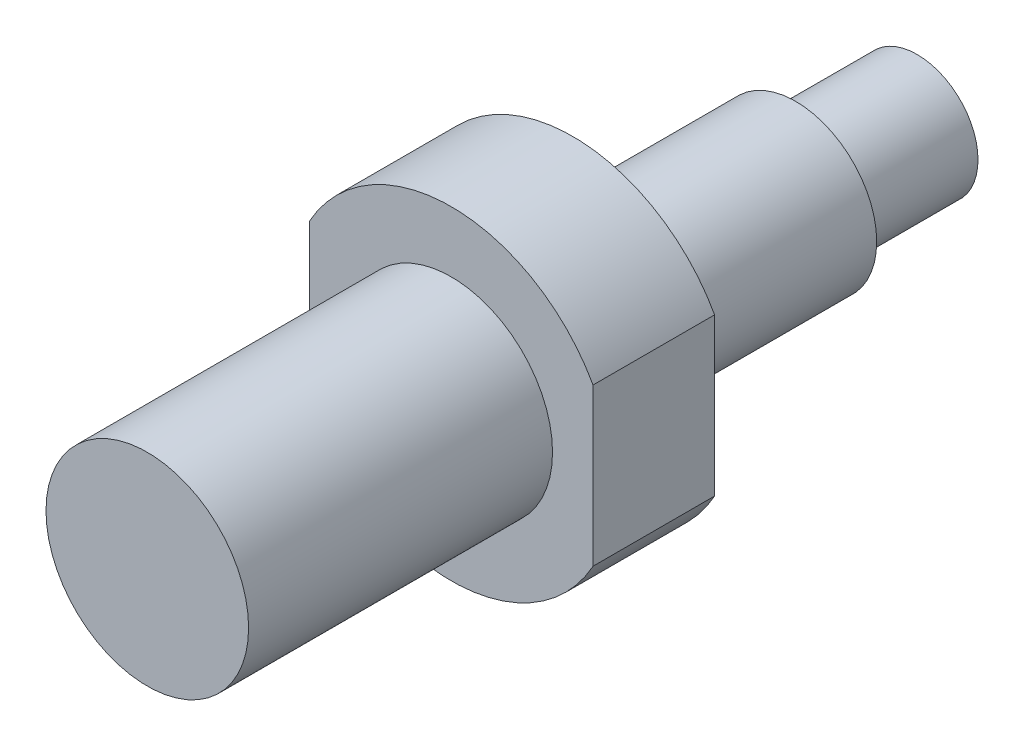
ISO-10303-21;
HEADER;
FILE_DESCRIPTION(('STEP AP214'),'2;1');
FILE_NAME('part.step','',(''),(''),'','','');
FILE_SCHEMA(('AUTOMOTIVE_DESIGN { 1 0 10303 214 1 1 1 1 }'));
ENDSEC;
DATA;
#1=APPLICATION_CONTEXT('core data for automotive mechanical design processes');
#2=APPLICATION_PROTOCOL_DEFINITION('international standard','automotive_design',2000,#1);
#3=PRODUCT_CONTEXT('',#1,'mechanical');
#4=PRODUCT('Part','Part','',(#3));
#5=PRODUCT_RELATED_PRODUCT_CATEGORY('part','',(#4));
#6=PRODUCT_DEFINITION_FORMATION('','',#4);
#7=PRODUCT_DEFINITION_CONTEXT('part definition',#1,'design');
#8=PRODUCT_DEFINITION('design','',#6,#7);
#9=PRODUCT_DEFINITION_SHAPE('','',#8);
#10=(LENGTH_UNIT() NAMED_UNIT(*) SI_UNIT(.MILLI.,.METRE.));
#11=(NAMED_UNIT(*) PLANE_ANGLE_UNIT() SI_UNIT($,.RADIAN.));
#12=(NAMED_UNIT(*) SI_UNIT($,.STERADIAN.) SOLID_ANGLE_UNIT());
#13=UNCERTAINTY_MEASURE_WITH_UNIT(LENGTH_MEASURE(1.E-05),#10,'distance_accuracy_value','');
#14=(GEOMETRIC_REPRESENTATION_CONTEXT(3) GLOBAL_UNCERTAINTY_ASSIGNED_CONTEXT((#13)) GLOBAL_UNIT_ASSIGNED_CONTEXT((#10,
#11,#12)) REPRESENTATION_CONTEXT('',''));
#15=CARTESIAN_POINT('',(0.,0.,0.));
#16=DIRECTION('',(0.,0.,1.));
#17=DIRECTION('',(1.,0.,0.));
#18=AXIS2_PLACEMENT_3D('',#15,#16,#17);
#19=CARTESIAN_POINT('',(0.,4.,-32.));
#20=DIRECTION('',(0.,0.,1.));
#21=DIRECTION('',(1.,0.,0.));
#22=AXIS2_PLACEMENT_3D('',#19,#20,#21);
#23=PLANE('',#22);
#24=CARTESIAN_POINT('',(0.,0.,-32.));
#25=DIRECTION('',(0.,0.,1.));
#26=DIRECTION('',(1.,0.,0.));
#27=AXIS2_PLACEMENT_3D('',#24,#25,#26);
#28=CIRCLE('',#27,4.);
#29=CARTESIAN_POINT('',(4.,0.,-32.));
#30=VERTEX_POINT('',#29);
#31=EDGE_CURVE('E125',#30,#30,#28,.T.);
#32=ORIENTED_EDGE('',*,*,#31,.F.);
#33=EDGE_LOOP('',(#32));
#34=FACE_BOUND('',#33,.T.);
#35=CARTESIAN_POINT('',(0.,0.,-32.));
#36=DIRECTION('',(0.,0.,1.));
#37=DIRECTION('',(1.,0.,0.));
#38=AXIS2_PLACEMENT_3D('',#35,#36,#37);
#39=CIRCLE('',#38,3.);
#40=CARTESIAN_POINT('',(3.,0.,-32.));
#41=VERTEX_POINT('',#40);
#42=EDGE_CURVE('E12',#41,#41,#39,.F.);
#43=ORIENTED_EDGE('',*,*,#42,.F.);
#44=EDGE_LOOP('',(#43));
#45=FACE_BOUND('',#44,.T.);
#46=ADVANCED_FACE('F40',(#34,#45),#23,.F.);
#47=CARTESIAN_POINT('',(0.,5.,-15.));
#48=DIRECTION('',(0.,0.,-1.));
#49=DIRECTION('',(-1.,0.,0.));
#50=AXIS2_PLACEMENT_3D('',#47,#48,#49);
#51=PLANE('',#50);
#52=CARTESIAN_POINT('',(0.,0.,-15.));
#53=DIRECTION('',(0.,0.,1.));
#54=DIRECTION('',(1.,0.,0.));
#55=AXIS2_PLACEMENT_3D('',#52,#53,#54);
#56=CIRCLE('',#55,5.);
#57=CARTESIAN_POINT('',(5.,0.,-15.));
#58=VERTEX_POINT('',#57);
#59=EDGE_CURVE('E106',#58,#58,#56,.T.);
#60=ORIENTED_EDGE('',*,*,#59,.F.);
#61=EDGE_LOOP('',(#60));
#62=FACE_BOUND('',#61,.T.);
#63=CARTESIAN_POINT('',(0.,0.,-15.));
#64=DIRECTION('',(0.,0.,-1.));
#65=DIRECTION('',(-1.,0.,0.));
#66=AXIS2_PLACEMENT_3D('',#63,#64,#65);
#67=CIRCLE('',#66,8.);
#68=CARTESIAN_POINT('',(-7.,3.87298334620742,-15.));
#69=VERTEX_POINT('',#68);
#70=CARTESIAN_POINT('',(7.,3.87298334620742,-15.));
#71=VERTEX_POINT('',#70);
#72=EDGE_CURVE('E82',#69,#71,#67,.T.);
#73=ORIENTED_EDGE('',*,*,#72,.F.);
#74=DIRECTION('',(0.,1.,0.));
#75=VECTOR('',#74,1.);
#76=CARTESIAN_POINT('',(-7.,-8.43799237337698,-15.));
#77=LINE('',#76,#75);
#78=CARTESIAN_POINT('',(-7.,-3.87298334620742,-15.));
#79=VERTEX_POINT('',#78);
#80=EDGE_CURVE('E116',#79,#69,#77,.T.);
#81=ORIENTED_EDGE('',*,*,#80,.F.);
#82=CARTESIAN_POINT('',(7.,-3.87298334620742,-15.));
#83=VERTEX_POINT('',#82);
#84=EDGE_CURVE('E55',#83,#79,#67,.T.);
#85=ORIENTED_EDGE('',*,*,#84,.F.);
#86=DIRECTION('',(0.,-1.,0.));
#87=VECTOR('',#86,1.);
#88=CARTESIAN_POINT('',(7.,-8.43799237337698,-15.));
#89=LINE('',#88,#87);
#90=EDGE_CURVE('E119',#71,#83,#89,.T.);
#91=ORIENTED_EDGE('',*,*,#90,.F.);
#92=EDGE_LOOP('',(#73,#81,#85,#91));
#93=FACE_BOUND('',#92,.T.);
#94=ADVANCED_FACE('F118',(#62,#93),#51,.F.);
#95=CARTESIAN_POINT('',(0.,9.,-21.));
#96=DIRECTION('',(0.,0.,1.));
#97=DIRECTION('',(1.,0.,0.));
#98=AXIS2_PLACEMENT_3D('',#95,#96,#97);
#99=PLANE('',#98);
#100=CARTESIAN_POINT('',(0.,0.,-21.));
#101=DIRECTION('',(0.,0.,1.));
#102=DIRECTION('',(1.,0.,0.));
#103=AXIS2_PLACEMENT_3D('',#100,#101,#102);
#104=CIRCLE('',#103,4.);
#105=CARTESIAN_POINT('',(4.,0.,-21.));
#106=VERTEX_POINT('',#105);
#107=EDGE_CURVE('E128',#106,#106,#104,.T.);
#108=ORIENTED_EDGE('',*,*,#107,.T.);
#109=EDGE_LOOP('',(#108));
#110=FACE_BOUND('',#109,.T.);
#111=CARTESIAN_POINT('',(0.,0.,-21.));
#112=DIRECTION('',(0.,0.,-1.));
#113=DIRECTION('',(-1.,0.,0.));
#114=AXIS2_PLACEMENT_3D('',#111,#112,#113);
#115=CIRCLE('',#114,8.);
#116=CARTESIAN_POINT('',(-7.,3.87298334620742,-21.));
#117=VERTEX_POINT('',#116);
#118=CARTESIAN_POINT('',(7.,3.87298334620742,-21.));
#119=VERTEX_POINT('',#118);
#120=EDGE_CURVE('E63',#117,#119,#115,.T.);
#121=ORIENTED_EDGE('',*,*,#120,.T.);
#122=DIRECTION('',(0.,-1.,0.));
#123=VECTOR('',#122,1.);
#124=CARTESIAN_POINT('',(7.,9.,-21.));
#125=LINE('',#124,#123);
#126=CARTESIAN_POINT('',(7.,-3.87298334620742,-21.));
#127=VERTEX_POINT('',#126);
#128=EDGE_CURVE('E93',#119,#127,#125,.T.);
#129=ORIENTED_EDGE('',*,*,#128,.T.);
#130=CARTESIAN_POINT('',(-7.,-3.87298334620742,-21.));
#131=VERTEX_POINT('',#130);
#132=EDGE_CURVE('E96',#127,#131,#115,.T.);
#133=ORIENTED_EDGE('',*,*,#132,.T.);
#134=DIRECTION('',(0.,1.,0.));
#135=VECTOR('',#134,1.);
#136=CARTESIAN_POINT('',(-7.,9.,-21.));
#137=LINE('',#136,#135);
#138=EDGE_CURVE('E95',#131,#117,#137,.T.);
#139=ORIENTED_EDGE('',*,*,#138,.T.);
#140=EDGE_LOOP('',(#121,#129,#133,#139));
#141=FACE_BOUND('',#140,.T.);
#142=ADVANCED_FACE('F91',(#110,#141),#99,.F.);
#143=CARTESIAN_POINT('',(7.,-8.43799237337698,-25.));
#144=DIRECTION('',(-1.,0.,0.));
#145=DIRECTION('',(0.,0.,1.));
#146=AXIS2_PLACEMENT_3D('',#143,#144,#145);
#147=PLANE('',#146);
#148=DIRECTION('',(0.,0.,-1.));
#149=VECTOR('',#148,1.);
#150=CARTESIAN_POINT('',(7.,3.87298334620742,-11.));
#151=LINE('',#150,#149);
#152=EDGE_CURVE('E79',#71,#119,#151,.T.);
#153=ORIENTED_EDGE('',*,*,#152,.F.);
#154=ORIENTED_EDGE('',*,*,#90,.T.);
#155=DIRECTION('',(0.,0.,-1.));
#156=VECTOR('',#155,1.);
#157=CARTESIAN_POINT('',(7.,-3.87298334620742,-11.));
#158=LINE('',#157,#156);
#159=EDGE_CURVE('E100',#127,#83,#158,.F.);
#160=ORIENTED_EDGE('',*,*,#159,.F.);
#161=ORIENTED_EDGE('',*,*,#128,.F.);
#162=EDGE_LOOP('',(#153,#154,#160,#161));
#163=FACE_BOUND('',#162,.T.);
#164=ADVANCED_FACE('F99',(#163),#147,.F.);
#165=CARTESIAN_POINT('',(-7.,-8.43799237337698,-25.));
#166=DIRECTION('',(1.,0.,0.));
#167=DIRECTION('',(0.,0.,-1.));
#168=AXIS2_PLACEMENT_3D('',#165,#166,#167);
#169=PLANE('',#168);
#170=DIRECTION('',(0.,0.,-1.));
#171=VECTOR('',#170,1.);
#172=CARTESIAN_POINT('',(-7.,-3.87298334620742,-11.));
#173=LINE('',#172,#171);
#174=EDGE_CURVE('E48',#79,#131,#173,.T.);
#175=ORIENTED_EDGE('',*,*,#174,.F.);
#176=ORIENTED_EDGE('',*,*,#80,.T.);
#177=DIRECTION('',(0.,0.,-1.));
#178=VECTOR('',#177,1.);
#179=CARTESIAN_POINT('',(-7.,3.87298334620742,-11.));
#180=LINE('',#179,#178);
#181=EDGE_CURVE('E103',#117,#69,#180,.F.);
#182=ORIENTED_EDGE('',*,*,#181,.F.);
#183=ORIENTED_EDGE('',*,*,#138,.F.);
#184=EDGE_LOOP('',(#175,#176,#182,#183));
#185=FACE_BOUND('',#184,.T.);
#186=ADVANCED_FACE('F115',(#185),#169,.F.);
#187=CARTESIAN_POINT('',(0.,0.,0.));
#188=DIRECTION('',(0.,0.,-1.));
#189=DIRECTION('',(-1.,0.,0.));
#190=AXIS2_PLACEMENT_3D('',#187,#188,#189);
#191=PLANE('',#190);
#192=CARTESIAN_POINT('',(0.,0.,0.));
#193=DIRECTION('',(0.,0.,1.));
#194=DIRECTION('',(1.,0.,0.));
#195=AXIS2_PLACEMENT_3D('',#192,#193,#194);
#196=CIRCLE('',#195,5.);
#197=CARTESIAN_POINT('',(5.,0.,0.));
#198=VERTEX_POINT('',#197);
#199=EDGE_CURVE('E101',#198,#198,#196,.T.);
#200=ORIENTED_EDGE('',*,*,#199,.T.);
#201=EDGE_LOOP('',(#200));
#202=FACE_BOUND('',#201,.T.);
#203=ADVANCED_FACE('F42',(#202),#191,.F.);
#204=CARTESIAN_POINT('',(0.,0.,0.));
#205=DIRECTION('',(0.,0.,1.));
#206=DIRECTION('',(1.,0.,0.));
#207=AXIS2_PLACEMENT_3D('',#204,#205,#206);
#208=CYLINDRICAL_SURFACE('',#207,5.);
#209=ORIENTED_EDGE('',*,*,#199,.F.);
#210=EDGE_LOOP('',(#209));
#211=FACE_BOUND('',#210,.T.);
#212=ORIENTED_EDGE('',*,*,#59,.T.);
#213=EDGE_LOOP('',(#212));
#214=FACE_BOUND('',#213,.T.);
#215=ADVANCED_FACE('F133',(#211,#214),#208,.T.);
#216=CARTESIAN_POINT('',(0.,0.,0.));
#217=DIRECTION('',(0.,0.,1.));
#218=DIRECTION('',(1.,0.,0.));
#219=AXIS2_PLACEMENT_3D('',#216,#217,#218);
#220=CYLINDRICAL_SURFACE('',#219,4.);
#221=ORIENTED_EDGE('',*,*,#107,.F.);
#222=EDGE_LOOP('',(#221));
#223=FACE_BOUND('',#222,.T.);
#224=ORIENTED_EDGE('',*,*,#31,.T.);
#225=EDGE_LOOP('',(#224));
#226=FACE_BOUND('',#225,.T.);
#227=ADVANCED_FACE('F147',(#223,#226),#220,.T.);
#228=CARTESIAN_POINT('',(0.,0.,-11.));
#229=DIRECTION('',(0.,0.,-1.));
#230=DIRECTION('',(-1.,0.,0.));
#231=AXIS2_PLACEMENT_3D('',#228,#229,#230);
#232=CYLINDRICAL_SURFACE('',#231,8.);
#233=ORIENTED_EDGE('',*,*,#152,.T.);
#234=ORIENTED_EDGE('',*,*,#120,.F.);
#235=ORIENTED_EDGE('',*,*,#181,.T.);
#236=ORIENTED_EDGE('',*,*,#72,.T.);
#237=EDGE_LOOP('',(#233,#234,#235,#236));
#238=FACE_BOUND('',#237,.T.);
#239=ADVANCED_FACE('F80',(#238),#232,.T.);
#240=ORIENTED_EDGE('',*,*,#159,.T.);
#241=ORIENTED_EDGE('',*,*,#84,.T.);
#242=ORIENTED_EDGE('',*,*,#174,.T.);
#243=ORIENTED_EDGE('',*,*,#132,.F.);
#244=EDGE_LOOP('',(#240,#241,#242,#243));
#245=FACE_BOUND('',#244,.T.);
#246=ADVANCED_FACE('F110',(#245),#232,.T.);
#247=CARTESIAN_POINT('',(0.,0.,-38.));
#248=DIRECTION('',(0.,0.,1.));
#249=DIRECTION('',(1.,0.,0.));
#250=AXIS2_PLACEMENT_3D('',#247,#248,#249);
#251=CYLINDRICAL_SURFACE('',#250,3.);
#252=CARTESIAN_POINT('',(0.,0.,-38.));
#253=DIRECTION('',(0.,0.,-1.));
#254=DIRECTION('',(-1.,0.,0.));
#255=AXIS2_PLACEMENT_3D('',#252,#253,#254);
#256=CIRCLE('',#255,3.);
#257=CARTESIAN_POINT('',(-3.,0.,-38.));
#258=VERTEX_POINT('',#257);
#259=EDGE_CURVE('E114',#258,#258,#256,.T.);
#260=ORIENTED_EDGE('',*,*,#259,.F.);
#261=EDGE_LOOP('',(#260));
#262=FACE_BOUND('',#261,.T.);
#263=ORIENTED_EDGE('',*,*,#42,.T.);
#264=EDGE_LOOP('',(#263));
#265=FACE_BOUND('',#264,.T.);
#266=ADVANCED_FACE('F167',(#262,#265),#251,.T.);
#267=CARTESIAN_POINT('',(0.,0.,-38.));
#268=DIRECTION('',(0.,0.,-1.));
#269=DIRECTION('',(-1.,0.,0.));
#270=AXIS2_PLACEMENT_3D('',#267,#268,#269);
#271=PLANE('',#270);
#272=ORIENTED_EDGE('',*,*,#259,.T.);
#273=EDGE_LOOP('',(#272));
#274=FACE_BOUND('',#273,.T.);
#275=ADVANCED_FACE('F170',(#274),#271,.T.);
#276=CLOSED_SHELL('',(#46,#94,#142,#164,#186,#203,#215,#227,#239,#246,#266,#275));
#277=MANIFOLD_SOLID_BREP('B2',#276);
#278=ADVANCED_BREP_SHAPE_REPRESENTATION('',(#18,#277),#14);
#279=SHAPE_DEFINITION_REPRESENTATION(#9,#278);
ENDSEC;
END-ISO-10303-21;
